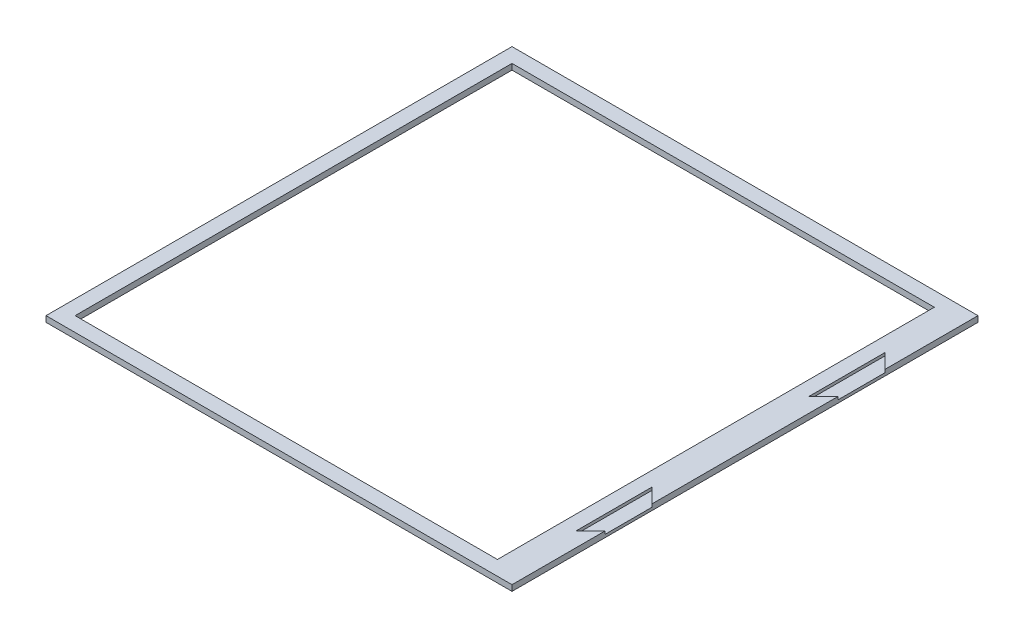
ISO-10303-21;
HEADER;
FILE_DESCRIPTION(('STEP AP214'),'2;1');
FILE_NAME('part.step','',(''),(''),'','','');
FILE_SCHEMA(('AUTOMOTIVE_DESIGN { 1 0 10303 214 1 1 1 1 }'));
ENDSEC;
DATA;
#1=APPLICATION_CONTEXT('core data for automotive mechanical design processes');
#2=APPLICATION_PROTOCOL_DEFINITION('international standard','automotive_design',2000,#1);
#3=PRODUCT_CONTEXT('',#1,'mechanical');
#4=PRODUCT('Part','Part','',(#3));
#5=PRODUCT_RELATED_PRODUCT_CATEGORY('part','',(#4));
#6=PRODUCT_DEFINITION_FORMATION('','',#4);
#7=PRODUCT_DEFINITION_CONTEXT('part definition',#1,'design');
#8=PRODUCT_DEFINITION('design','',#6,#7);
#9=PRODUCT_DEFINITION_SHAPE('','',#8);
#10=(LENGTH_UNIT() NAMED_UNIT(*) SI_UNIT(.MILLI.,.METRE.));
#11=(NAMED_UNIT(*) PLANE_ANGLE_UNIT() SI_UNIT($,.RADIAN.));
#12=(NAMED_UNIT(*) SI_UNIT($,.STERADIAN.) SOLID_ANGLE_UNIT());
#13=UNCERTAINTY_MEASURE_WITH_UNIT(LENGTH_MEASURE(1.E-05),#10,'distance_accuracy_value','');
#14=(GEOMETRIC_REPRESENTATION_CONTEXT(3) GLOBAL_UNCERTAINTY_ASSIGNED_CONTEXT((#13)) GLOBAL_UNIT_ASSIGNED_CONTEXT((#10,
#11,#12)) REPRESENTATION_CONTEXT('',''));
#15=CARTESIAN_POINT('',(0.,0.,0.));
#16=DIRECTION('',(0.,0.,1.));
#17=DIRECTION('',(1.,0.,0.));
#18=AXIS2_PLACEMENT_3D('',#15,#16,#17);
#19=CARTESIAN_POINT('',(-95.25,1.27,-95.25));
#20=DIRECTION('',(0.,0.,1.));
#21=DIRECTION('',(1.,0.,0.));
#22=AXIS2_PLACEMENT_3D('',#19,#20,#21);
#23=PLANE('',#22);
#24=DIRECTION('',(-1.,0.,0.));
#25=VECTOR('',#24,1.);
#26=CARTESIAN_POINT('',(-95.25,-1.27,-95.25));
#27=LINE('',#26,#25);
#28=CARTESIAN_POINT('',(88.9,-1.27,-95.25));
#29=VERTEX_POINT('',#28);
#30=CARTESIAN_POINT('',(-95.25,-1.27,-95.25));
#31=VERTEX_POINT('',#30);
#32=EDGE_CURVE('E215',#29,#31,#27,.T.);
#33=ORIENTED_EDGE('',*,*,#32,.F.);
#34=DIRECTION('',(0.,-1.,0.));
#35=VECTOR('',#34,1.);
#36=CARTESIAN_POINT('',(88.9,1.27,-95.25));
#37=LINE('',#36,#35);
#38=CARTESIAN_POINT('',(88.9,1.27,-95.25));
#39=VERTEX_POINT('',#38);
#40=EDGE_CURVE('E213',#39,#29,#37,.T.);
#41=ORIENTED_EDGE('',*,*,#40,.F.);
#42=DIRECTION('',(-1.,0.,0.));
#43=VECTOR('',#42,1.);
#44=CARTESIAN_POINT('',(-95.25,1.27,-95.25));
#45=LINE('',#44,#43);
#46=CARTESIAN_POINT('',(-95.25,1.27,-95.25));
#47=VERTEX_POINT('',#46);
#48=EDGE_CURVE('E216',#39,#47,#45,.T.);
#49=ORIENTED_EDGE('',*,*,#48,.T.);
#50=DIRECTION('',(0.,-1.,0.));
#51=VECTOR('',#50,1.);
#52=CARTESIAN_POINT('',(-95.25,1.27,-95.25));
#53=LINE('',#52,#51);
#54=EDGE_CURVE('E233',#47,#31,#53,.T.);
#55=ORIENTED_EDGE('',*,*,#54,.T.);
#56=EDGE_LOOP('',(#33,#41,#49,#55));
#57=FACE_BOUND('',#56,.T.);
#58=ADVANCED_FACE('F37',(#57),#23,.T.);
#59=CARTESIAN_POINT('',(-95.25,1.27,95.25));
#60=DIRECTION('',(0.,0.,-1.));
#61=DIRECTION('',(-1.,0.,0.));
#62=AXIS2_PLACEMENT_3D('',#59,#60,#61);
#63=PLANE('',#62);
#64=DIRECTION('',(1.,0.,0.));
#65=VECTOR('',#64,1.);
#66=CARTESIAN_POINT('',(-95.25,1.27,95.25));
#67=LINE('',#66,#65);
#68=CARTESIAN_POINT('',(-95.25,1.27,95.25));
#69=VERTEX_POINT('',#68);
#70=CARTESIAN_POINT('',(88.9,1.27,95.25));
#71=VERTEX_POINT('',#70);
#72=EDGE_CURVE('E222',#69,#71,#67,.T.);
#73=ORIENTED_EDGE('',*,*,#72,.T.);
#74=DIRECTION('',(0.,-1.,0.));
#75=VECTOR('',#74,1.);
#76=CARTESIAN_POINT('',(88.9,1.27,95.25));
#77=LINE('',#76,#75);
#78=CARTESIAN_POINT('',(88.9,-1.27,95.25));
#79=VERTEX_POINT('',#78);
#80=EDGE_CURVE('E207',#71,#79,#77,.T.);
#81=ORIENTED_EDGE('',*,*,#80,.T.);
#82=DIRECTION('',(1.,0.,0.));
#83=VECTOR('',#82,1.);
#84=CARTESIAN_POINT('',(-95.25,-1.27,95.25));
#85=LINE('',#84,#83);
#86=CARTESIAN_POINT('',(-95.25,-1.27,95.25));
#87=VERTEX_POINT('',#86);
#88=EDGE_CURVE('E219',#87,#79,#85,.T.);
#89=ORIENTED_EDGE('',*,*,#88,.F.);
#90=DIRECTION('',(0.,-1.,0.));
#91=VECTOR('',#90,1.);
#92=CARTESIAN_POINT('',(-95.25,1.27,95.25));
#93=LINE('',#92,#91);
#94=EDGE_CURVE('E225',#69,#87,#93,.T.);
#95=ORIENTED_EDGE('',*,*,#94,.F.);
#96=EDGE_LOOP('',(#73,#81,#89,#95));
#97=FACE_BOUND('',#96,.T.);
#98=ADVANCED_FACE('F292',(#97),#63,.T.);
#99=CARTESIAN_POINT('',(0.,1.27,0.));
#100=DIRECTION('',(0.,-1.,0.));
#101=DIRECTION('',(0.,0.,-1.));
#102=AXIS2_PLACEMENT_3D('',#99,#100,#101);
#103=PLANE('',#102);
#104=ORIENTED_EDGE('',*,*,#48,.F.);
#105=DIRECTION('',(0.,0.,1.));
#106=VECTOR('',#105,1.);
#107=CARTESIAN_POINT('',(88.9,1.27,-95.25));
#108=LINE('',#107,#106);
#109=EDGE_CURVE('E205',#39,#71,#108,.T.);
#110=ORIENTED_EDGE('',*,*,#109,.T.);
#111=ORIENTED_EDGE('',*,*,#72,.F.);
#112=DIRECTION('',(0.,0.,1.));
#113=VECTOR('',#112,1.);
#114=CARTESIAN_POINT('',(-95.25,1.27,95.25));
#115=LINE('',#114,#113);
#116=EDGE_CURVE('E218',#47,#69,#115,.T.);
#117=ORIENTED_EDGE('',*,*,#116,.F.);
#118=EDGE_LOOP('',(#104,#110,#111,#117));
#119=FACE_BOUND('',#118,.T.);
#120=DIRECTION('',(0.,0.,-1.));
#121=VECTOR('',#120,1.);
#122=CARTESIAN_POINT('',(101.6,1.27,101.6));
#123=LINE('',#122,#121);
#124=CARTESIAN_POINT('',(101.6,1.27,40.64));
#125=VERTEX_POINT('',#124);
#126=CARTESIAN_POINT('',(101.6,1.27,-40.64));
#127=VERTEX_POINT('',#126);
#128=EDGE_CURVE('E241',#125,#127,#123,.T.);
#129=ORIENTED_EDGE('',*,*,#128,.T.);
#130=DIRECTION('',(0.707106781186544,0.,-0.707106781186551));
#131=VECTOR('',#130,1.);
#132=CARTESIAN_POINT('',(101.6,1.27,-40.64));
#133=LINE('',#132,#131);
#134=CARTESIAN_POINT('',(95.25,1.27,-34.29));
#135=VERTEX_POINT('',#134);
#136=EDGE_CURVE('E168',#135,#127,#133,.T.);
#137=ORIENTED_EDGE('',*,*,#136,.F.);
#138=DIRECTION('',(0.,0.,1.));
#139=VECTOR('',#138,1.);
#140=CARTESIAN_POINT('',(95.25,1.27,-34.29));
#141=LINE('',#140,#139);
#142=CARTESIAN_POINT('',(95.25,1.27,-67.3100000000001));
#143=VERTEX_POINT('',#142);
#144=EDGE_CURVE('E502',#143,#135,#141,.T.);
#145=ORIENTED_EDGE('',*,*,#144,.F.);
#146=DIRECTION('',(-0.707106781186544,0.,-0.707106781186551));
#147=VECTOR('',#146,1.);
#148=CARTESIAN_POINT('',(95.25,1.27,-67.3100000000001));
#149=LINE('',#148,#147);
#150=CARTESIAN_POINT('',(101.6,1.27,-60.96));
#151=VERTEX_POINT('',#150);
#152=EDGE_CURVE('E197',#151,#143,#149,.T.);
#153=ORIENTED_EDGE('',*,*,#152,.F.);
#154=CARTESIAN_POINT('',(101.6,1.27,-101.6));
#155=VERTEX_POINT('',#154);
#156=EDGE_CURVE('E172',#151,#155,#123,.T.);
#157=ORIENTED_EDGE('',*,*,#156,.T.);
#158=DIRECTION('',(-1.,0.,0.));
#159=VECTOR('',#158,1.);
#160=CARTESIAN_POINT('',(-101.6,1.27,-101.6));
#161=LINE('',#160,#159);
#162=CARTESIAN_POINT('',(-101.6,1.27,-101.6));
#163=VERTEX_POINT('',#162);
#164=EDGE_CURVE('E240',#155,#163,#161,.T.);
#165=ORIENTED_EDGE('',*,*,#164,.T.);
#166=DIRECTION('',(0.,0.,1.));
#167=VECTOR('',#166,1.);
#168=CARTESIAN_POINT('',(-101.6,1.27,101.6));
#169=LINE('',#168,#167);
#170=CARTESIAN_POINT('',(-101.6,1.27,101.6));
#171=VERTEX_POINT('',#170);
#172=EDGE_CURVE('E243',#163,#171,#169,.T.);
#173=ORIENTED_EDGE('',*,*,#172,.T.);
#174=DIRECTION('',(1.,0.,0.));
#175=VECTOR('',#174,1.);
#176=CARTESIAN_POINT('',(-101.6,1.27,101.6));
#177=LINE('',#176,#175);
#178=CARTESIAN_POINT('',(101.6,1.27,101.6));
#179=VERTEX_POINT('',#178);
#180=EDGE_CURVE('E245',#171,#179,#177,.T.);
#181=ORIENTED_EDGE('',*,*,#180,.T.);
#182=CARTESIAN_POINT('',(101.6,1.27,60.96));
#183=VERTEX_POINT('',#182);
#184=EDGE_CURVE('E237',#179,#183,#123,.T.);
#185=ORIENTED_EDGE('',*,*,#184,.T.);
#186=DIRECTION('',(0.707106781186544,0.,-0.707106781186551));
#187=VECTOR('',#186,1.);
#188=CARTESIAN_POINT('',(95.25,1.27,67.3100000000001));
#189=LINE('',#188,#187);
#190=CARTESIAN_POINT('',(95.25,1.27,67.3100000000001));
#191=VERTEX_POINT('',#190);
#192=EDGE_CURVE('E195',#191,#183,#189,.T.);
#193=ORIENTED_EDGE('',*,*,#192,.F.);
#194=DIRECTION('',(0.,0.,1.));
#195=VECTOR('',#194,1.);
#196=CARTESIAN_POINT('',(95.25,1.27,34.29));
#197=LINE('',#196,#195);
#198=CARTESIAN_POINT('',(95.25,1.27,34.29));
#199=VERTEX_POINT('',#198);
#200=EDGE_CURVE('E189',#199,#191,#197,.T.);
#201=ORIENTED_EDGE('',*,*,#200,.F.);
#202=DIRECTION('',(-0.707106781186544,0.,-0.707106781186551));
#203=VECTOR('',#202,1.);
#204=CARTESIAN_POINT('',(101.6,1.27,40.64));
#205=LINE('',#204,#203);
#206=EDGE_CURVE('E192',#125,#199,#205,.T.);
#207=ORIENTED_EDGE('',*,*,#206,.F.);
#208=EDGE_LOOP('',(#129,#137,#145,#153,#157,#165,#173,#181,#185,#193,#201,#207));
#209=FACE_BOUND('',#208,.T.);
#210=ADVANCED_FACE('F282',(#119,#209),#103,.F.);
#211=CARTESIAN_POINT('',(0.,-1.27,0.));
#212=DIRECTION('',(0.,-1.,0.));
#213=DIRECTION('',(0.,0.,-1.));
#214=AXIS2_PLACEMENT_3D('',#211,#212,#213);
#215=PLANE('',#214);
#216=DIRECTION('',(0.,0.,1.));
#217=VECTOR('',#216,1.);
#218=CARTESIAN_POINT('',(88.9,-1.27,-95.25));
#219=LINE('',#218,#217);
#220=EDGE_CURVE('E208',#29,#79,#219,.T.);
#221=ORIENTED_EDGE('',*,*,#220,.F.);
#222=ORIENTED_EDGE('',*,*,#32,.T.);
#223=DIRECTION('',(0.,0.,1.));
#224=VECTOR('',#223,1.);
#225=CARTESIAN_POINT('',(-95.25,-1.27,95.25));
#226=LINE('',#225,#224);
#227=EDGE_CURVE('E227',#31,#87,#226,.T.);
#228=ORIENTED_EDGE('',*,*,#227,.T.);
#229=ORIENTED_EDGE('',*,*,#88,.T.);
#230=EDGE_LOOP('',(#221,#222,#228,#229));
#231=FACE_BOUND('',#230,.T.);
#232=DIRECTION('',(0.,0.,-1.));
#233=VECTOR('',#232,1.);
#234=CARTESIAN_POINT('',(101.6,-1.27,101.6));
#235=LINE('',#234,#233);
#236=CARTESIAN_POINT('',(101.6,-1.27,101.6));
#237=VERTEX_POINT('',#236);
#238=CARTESIAN_POINT('',(101.6,-1.27,-101.6));
#239=VERTEX_POINT('',#238);
#240=EDGE_CURVE('E236',#237,#239,#235,.T.);
#241=ORIENTED_EDGE('',*,*,#240,.F.);
#242=DIRECTION('',(1.,0.,0.));
#243=VECTOR('',#242,1.);
#244=CARTESIAN_POINT('',(-101.6,-1.27,101.6));
#245=LINE('',#244,#243);
#246=CARTESIAN_POINT('',(-101.6,-1.27,101.6));
#247=VERTEX_POINT('',#246);
#248=EDGE_CURVE('E254',#247,#237,#245,.T.);
#249=ORIENTED_EDGE('',*,*,#248,.F.);
#250=DIRECTION('',(0.,0.,1.));
#251=VECTOR('',#250,1.);
#252=CARTESIAN_POINT('',(-101.6,-1.27,101.6));
#253=LINE('',#252,#251);
#254=CARTESIAN_POINT('',(-101.6,-1.27,-101.6));
#255=VERTEX_POINT('',#254);
#256=EDGE_CURVE('E252',#255,#247,#253,.T.);
#257=ORIENTED_EDGE('',*,*,#256,.F.);
#258=DIRECTION('',(-1.,0.,0.));
#259=VECTOR('',#258,1.);
#260=CARTESIAN_POINT('',(-101.6,-1.27,-101.6));
#261=LINE('',#260,#259);
#262=EDGE_CURVE('E250',#239,#255,#261,.T.);
#263=ORIENTED_EDGE('',*,*,#262,.F.);
#264=EDGE_LOOP('',(#241,#249,#257,#263));
#265=FACE_BOUND('',#264,.T.);
#266=ADVANCED_FACE('F272',(#231,#265),#215,.T.);
#267=CARTESIAN_POINT('',(101.6,1.27,101.6));
#268=DIRECTION('',(-1.,0.,0.));
#269=DIRECTION('',(0.,0.,1.));
#270=AXIS2_PLACEMENT_3D('',#267,#268,#269);
#271=PLANE('',#270);
#272=DIRECTION('',(0.,0.,-1.));
#273=VECTOR('',#272,1.);
#274=CARTESIAN_POINT('',(101.6,0.,-60.96));
#275=LINE('',#274,#273);
#276=CARTESIAN_POINT('',(101.6,0.,-40.64));
#277=VERTEX_POINT('',#276);
#278=CARTESIAN_POINT('',(101.6,0.,-60.96));
#279=VERTEX_POINT('',#278);
#280=EDGE_CURVE('E162',#277,#279,#275,.T.);
#281=ORIENTED_EDGE('',*,*,#280,.F.);
#282=DIRECTION('',(0.,1.,0.));
#283=VECTOR('',#282,1.);
#284=CARTESIAN_POINT('',(101.6,0.,-40.64));
#285=LINE('',#284,#283);
#286=EDGE_CURVE('E210',#277,#127,#285,.T.);
#287=ORIENTED_EDGE('',*,*,#286,.T.);
#288=ORIENTED_EDGE('',*,*,#128,.F.);
#289=DIRECTION('',(0.,1.,0.));
#290=VECTOR('',#289,1.);
#291=CARTESIAN_POINT('',(101.6,0.,40.64));
#292=LINE('',#291,#290);
#293=CARTESIAN_POINT('',(101.6,0.,40.64));
#294=VERTEX_POINT('',#293);
#295=EDGE_CURVE('E183',#294,#125,#292,.T.);
#296=ORIENTED_EDGE('',*,*,#295,.F.);
#297=DIRECTION('',(0.,0.,-1.));
#298=VECTOR('',#297,1.);
#299=CARTESIAN_POINT('',(101.6,0.,60.96));
#300=LINE('',#299,#298);
#301=CARTESIAN_POINT('',(101.6,0.,60.96));
#302=VERTEX_POINT('',#301);
#303=EDGE_CURVE('E202',#302,#294,#300,.T.);
#304=ORIENTED_EDGE('',*,*,#303,.F.);
#305=DIRECTION('',(0.,1.,0.));
#306=VECTOR('',#305,1.);
#307=CARTESIAN_POINT('',(101.6,0.,60.96));
#308=LINE('',#307,#306);
#309=EDGE_CURVE('E179',#302,#183,#308,.T.);
#310=ORIENTED_EDGE('',*,*,#309,.T.);
#311=ORIENTED_EDGE('',*,*,#184,.F.);
#312=DIRECTION('',(0.,-1.,0.));
#313=VECTOR('',#312,1.);
#314=CARTESIAN_POINT('',(101.6,1.27,101.6));
#315=LINE('',#314,#313);
#316=EDGE_CURVE('E247',#179,#237,#315,.T.);
#317=ORIENTED_EDGE('',*,*,#316,.T.);
#318=ORIENTED_EDGE('',*,*,#240,.T.);
#319=DIRECTION('',(0.,-1.,0.));
#320=VECTOR('',#319,1.);
#321=CARTESIAN_POINT('',(101.6,1.27,-101.6));
#322=LINE('',#321,#320);
#323=EDGE_CURVE('E11',#155,#239,#322,.T.);
#324=ORIENTED_EDGE('',*,*,#323,.F.);
#325=ORIENTED_EDGE('',*,*,#156,.F.);
#326=DIRECTION('',(0.,1.,0.));
#327=VECTOR('',#326,1.);
#328=CARTESIAN_POINT('',(101.6,0.,-60.96));
#329=LINE('',#328,#327);
#330=EDGE_CURVE('E157',#279,#151,#329,.T.);
#331=ORIENTED_EDGE('',*,*,#330,.F.);
#332=EDGE_LOOP('',(#281,#287,#288,#296,#304,#310,#311,#317,#318,#324,#325,#331));
#333=FACE_BOUND('',#332,.T.);
#334=ADVANCED_FACE('F39',(#333),#271,.F.);
#335=CARTESIAN_POINT('',(-101.6,1.27,-101.6));
#336=DIRECTION('',(0.,0.,1.));
#337=DIRECTION('',(1.,0.,0.));
#338=AXIS2_PLACEMENT_3D('',#335,#336,#337);
#339=PLANE('',#338);
#340=ORIENTED_EDGE('',*,*,#262,.T.);
#341=DIRECTION('',(0.,-1.,0.));
#342=VECTOR('',#341,1.);
#343=CARTESIAN_POINT('',(-101.6,1.27,-101.6));
#344=LINE('',#343,#342);
#345=EDGE_CURVE('E45',#163,#255,#344,.T.);
#346=ORIENTED_EDGE('',*,*,#345,.F.);
#347=ORIENTED_EDGE('',*,*,#164,.F.);
#348=ORIENTED_EDGE('',*,*,#323,.T.);
#349=EDGE_LOOP('',(#340,#346,#347,#348));
#350=FACE_BOUND('',#349,.T.);
#351=ADVANCED_FACE('F284',(#350),#339,.F.);
#352=CARTESIAN_POINT('',(-101.6,1.27,101.6));
#353=DIRECTION('',(1.,0.,0.));
#354=DIRECTION('',(0.,0.,-1.));
#355=AXIS2_PLACEMENT_3D('',#352,#353,#354);
#356=PLANE('',#355);
#357=ORIENTED_EDGE('',*,*,#256,.T.);
#358=DIRECTION('',(0.,-1.,0.));
#359=VECTOR('',#358,1.);
#360=CARTESIAN_POINT('',(-101.6,1.27,101.6));
#361=LINE('',#360,#359);
#362=EDGE_CURVE('E258',#171,#247,#361,.T.);
#363=ORIENTED_EDGE('',*,*,#362,.F.);
#364=ORIENTED_EDGE('',*,*,#172,.F.);
#365=ORIENTED_EDGE('',*,*,#345,.T.);
#366=EDGE_LOOP('',(#357,#363,#364,#365));
#367=FACE_BOUND('',#366,.T.);
#368=ADVANCED_FACE('F265',(#367),#356,.F.);
#369=CARTESIAN_POINT('',(-101.6,1.27,101.6));
#370=DIRECTION('',(0.,0.,-1.));
#371=DIRECTION('',(-1.,0.,0.));
#372=AXIS2_PLACEMENT_3D('',#369,#370,#371);
#373=PLANE('',#372);
#374=ORIENTED_EDGE('',*,*,#248,.T.);
#375=ORIENTED_EDGE('',*,*,#316,.F.);
#376=ORIENTED_EDGE('',*,*,#180,.F.);
#377=ORIENTED_EDGE('',*,*,#362,.T.);
#378=EDGE_LOOP('',(#374,#375,#376,#377));
#379=FACE_BOUND('',#378,.T.);
#380=ADVANCED_FACE('F275',(#379),#373,.F.);
#381=CARTESIAN_POINT('',(-95.25,1.27,95.25));
#382=DIRECTION('',(1.,0.,0.));
#383=DIRECTION('',(0.,0.,-1.));
#384=AXIS2_PLACEMENT_3D('',#381,#382,#383);
#385=PLANE('',#384);
#386=ORIENTED_EDGE('',*,*,#227,.F.);
#387=ORIENTED_EDGE('',*,*,#54,.F.);
#388=ORIENTED_EDGE('',*,*,#116,.T.);
#389=ORIENTED_EDGE('',*,*,#94,.T.);
#390=EDGE_LOOP('',(#386,#387,#388,#389));
#391=FACE_BOUND('',#390,.T.);
#392=ADVANCED_FACE('F303',(#391),#385,.T.);
#393=CARTESIAN_POINT('',(88.9,1.27,-95.25));
#394=DIRECTION('',(1.,0.,0.));
#395=DIRECTION('',(0.,0.,-1.));
#396=AXIS2_PLACEMENT_3D('',#393,#394,#395);
#397=PLANE('',#396);
#398=ORIENTED_EDGE('',*,*,#220,.T.);
#399=ORIENTED_EDGE('',*,*,#80,.F.);
#400=ORIENTED_EDGE('',*,*,#109,.F.);
#401=ORIENTED_EDGE('',*,*,#40,.T.);
#402=EDGE_LOOP('',(#398,#399,#400,#401));
#403=FACE_BOUND('',#402,.T.);
#404=ADVANCED_FACE('F314',(#403),#397,.F.);
#405=CARTESIAN_POINT('',(95.25,0.,67.3100000000001));
#406=DIRECTION('',(0.707106781186551,0.,0.707106781186544));
#407=DIRECTION('',(0.707106781186544,0.,-0.707106781186551));
#408=AXIS2_PLACEMENT_3D('',#405,#406,#407);
#409=PLANE('',#408);
#410=ORIENTED_EDGE('',*,*,#192,.T.);
#411=ORIENTED_EDGE('',*,*,#309,.F.);
#412=DIRECTION('',(0.707106781186544,0.,-0.707106781186551));
#413=VECTOR('',#412,1.);
#414=CARTESIAN_POINT('',(95.25,0.,67.3100000000001));
#415=LINE('',#414,#413);
#416=CARTESIAN_POINT('',(95.25,0.,67.3100000000001));
#417=VERTEX_POINT('',#416);
#418=EDGE_CURVE('E60',#417,#302,#415,.T.);
#419=ORIENTED_EDGE('',*,*,#418,.F.);
#420=DIRECTION('',(0.,1.,0.));
#421=VECTOR('',#420,1.);
#422=CARTESIAN_POINT('',(95.25,0.,67.3100000000001));
#423=LINE('',#422,#421);
#424=EDGE_CURVE('E187',#417,#191,#423,.T.);
#425=ORIENTED_EDGE('',*,*,#424,.T.);
#426=EDGE_LOOP('',(#410,#411,#419,#425));
#427=FACE_BOUND('',#426,.T.);
#428=ADVANCED_FACE('F319',(#427),#409,.F.);
#429=CARTESIAN_POINT('',(95.25,0.,34.29));
#430=DIRECTION('',(-1.,0.,0.));
#431=DIRECTION('',(0.,0.,1.));
#432=AXIS2_PLACEMENT_3D('',#429,#430,#431);
#433=PLANE('',#432);
#434=ORIENTED_EDGE('',*,*,#200,.T.);
#435=ORIENTED_EDGE('',*,*,#424,.F.);
#436=DIRECTION('',(0.,0.,1.));
#437=VECTOR('',#436,1.);
#438=CARTESIAN_POINT('',(95.25,0.,34.29));
#439=LINE('',#438,#437);
#440=CARTESIAN_POINT('',(95.25,0.,34.29));
#441=VERTEX_POINT('',#440);
#442=EDGE_CURVE('E182',#441,#417,#439,.T.);
#443=ORIENTED_EDGE('',*,*,#442,.F.);
#444=DIRECTION('',(0.,1.,0.));
#445=VECTOR('',#444,1.);
#446=CARTESIAN_POINT('',(95.25,0.,34.29));
#447=LINE('',#446,#445);
#448=EDGE_CURVE('E185',#441,#199,#447,.T.);
#449=ORIENTED_EDGE('',*,*,#448,.T.);
#450=EDGE_LOOP('',(#434,#435,#443,#449));
#451=FACE_BOUND('',#450,.T.);
#452=ADVANCED_FACE('F334',(#451),#433,.F.);
#453=CARTESIAN_POINT('',(101.6,0.,40.64));
#454=DIRECTION('',(0.707106781186551,0.,-0.707106781186544));
#455=DIRECTION('',(-0.707106781186544,0.,-0.707106781186551));
#456=AXIS2_PLACEMENT_3D('',#453,#454,#455);
#457=PLANE('',#456);
#458=ORIENTED_EDGE('',*,*,#206,.T.);
#459=ORIENTED_EDGE('',*,*,#448,.F.);
#460=DIRECTION('',(-0.707106781186544,0.,-0.707106781186551));
#461=VECTOR('',#460,1.);
#462=CARTESIAN_POINT('',(101.6,0.,40.64));
#463=LINE('',#462,#461);
#464=EDGE_CURVE('E199',#294,#441,#463,.T.);
#465=ORIENTED_EDGE('',*,*,#464,.F.);
#466=ORIENTED_EDGE('',*,*,#295,.T.);
#467=EDGE_LOOP('',(#458,#459,#465,#466));
#468=FACE_BOUND('',#467,.T.);
#469=ADVANCED_FACE('F342',(#468),#457,.F.);
#470=CARTESIAN_POINT('',(0.,0.,0.));
#471=DIRECTION('',(0.,1.,0.));
#472=DIRECTION('',(0.,0.,1.));
#473=AXIS2_PLACEMENT_3D('',#470,#471,#472);
#474=PLANE('',#473);
#475=ORIENTED_EDGE('',*,*,#418,.T.);
#476=ORIENTED_EDGE('',*,*,#303,.T.);
#477=ORIENTED_EDGE('',*,*,#464,.T.);
#478=ORIENTED_EDGE('',*,*,#442,.T.);
#479=EDGE_LOOP('',(#475,#476,#477,#478));
#480=FACE_BOUND('',#479,.T.);
#481=ADVANCED_FACE('F338',(#480),#474,.T.);
#482=CARTESIAN_POINT('',(101.6,0.,-40.64));
#483=DIRECTION('',(0.707106781186551,0.,0.707106781186544));
#484=DIRECTION('',(0.707106781186544,0.,-0.707106781186551));
#485=AXIS2_PLACEMENT_3D('',#482,#483,#484);
#486=PLANE('',#485);
#487=ORIENTED_EDGE('',*,*,#136,.T.);
#488=ORIENTED_EDGE('',*,*,#286,.F.);
#489=DIRECTION('',(0.707106781186544,0.,-0.707106781186551));
#490=VECTOR('',#489,1.);
#491=CARTESIAN_POINT('',(101.6,0.,-40.64));
#492=LINE('',#491,#490);
#493=CARTESIAN_POINT('',(95.25,0.,-34.29));
#494=VERTEX_POINT('',#493);
#495=EDGE_CURVE('E52',#494,#277,#492,.T.);
#496=ORIENTED_EDGE('',*,*,#495,.F.);
#497=DIRECTION('',(0.,1.,0.));
#498=VECTOR('',#497,1.);
#499=CARTESIAN_POINT('',(95.25,0.,-34.29));
#500=LINE('',#499,#498);
#501=EDGE_CURVE('E174',#494,#135,#500,.T.);
#502=ORIENTED_EDGE('',*,*,#501,.T.);
#503=EDGE_LOOP('',(#487,#488,#496,#502));
#504=FACE_BOUND('',#503,.T.);
#505=ADVANCED_FACE('F341',(#504),#486,.F.);
#506=CARTESIAN_POINT('',(95.25,0.,-34.29));
#507=DIRECTION('',(-1.,0.,0.));
#508=DIRECTION('',(0.,0.,1.));
#509=AXIS2_PLACEMENT_3D('',#506,#507,#508);
#510=PLANE('',#509);
#511=ORIENTED_EDGE('',*,*,#144,.T.);
#512=ORIENTED_EDGE('',*,*,#501,.F.);
#513=DIRECTION('',(0.,0.,1.));
#514=VECTOR('',#513,1.);
#515=CARTESIAN_POINT('',(95.25,0.,-34.29));
#516=LINE('',#515,#514);
#517=CARTESIAN_POINT('',(95.25,0.,-67.3100000000001));
#518=VERTEX_POINT('',#517);
#519=EDGE_CURVE('E161',#518,#494,#516,.T.);
#520=ORIENTED_EDGE('',*,*,#519,.F.);
#521=DIRECTION('',(0.,1.,0.));
#522=VECTOR('',#521,1.);
#523=CARTESIAN_POINT('',(95.25,0.,-67.3100000000001));
#524=LINE('',#523,#522);
#525=EDGE_CURVE('E159',#518,#143,#524,.T.);
#526=ORIENTED_EDGE('',*,*,#525,.T.);
#527=EDGE_LOOP('',(#511,#512,#520,#526));
#528=FACE_BOUND('',#527,.T.);
#529=ADVANCED_FACE('F351',(#528),#510,.F.);
#530=CARTESIAN_POINT('',(95.25,0.,-67.3100000000001));
#531=DIRECTION('',(0.707106781186551,0.,-0.707106781186544));
#532=DIRECTION('',(-0.707106781186544,0.,-0.707106781186551));
#533=AXIS2_PLACEMENT_3D('',#530,#531,#532);
#534=PLANE('',#533);
#535=ORIENTED_EDGE('',*,*,#152,.T.);
#536=ORIENTED_EDGE('',*,*,#525,.F.);
#537=DIRECTION('',(-0.707106781186544,0.,-0.707106781186551));
#538=VECTOR('',#537,1.);
#539=CARTESIAN_POINT('',(95.25,0.,-67.3100000000001));
#540=LINE('',#539,#538);
#541=EDGE_CURVE('E153',#279,#518,#540,.T.);
#542=ORIENTED_EDGE('',*,*,#541,.F.);
#543=ORIENTED_EDGE('',*,*,#330,.T.);
#544=EDGE_LOOP('',(#535,#536,#542,#543));
#545=FACE_BOUND('',#544,.T.);
#546=ADVANCED_FACE('F155',(#545),#534,.F.);
#547=CARTESIAN_POINT('',(0.,0.,0.));
#548=DIRECTION('',(0.,-1.,0.));
#549=DIRECTION('',(0.,0.,-1.));
#550=AXIS2_PLACEMENT_3D('',#547,#548,#549);
#551=PLANE('',#550);
#552=ORIENTED_EDGE('',*,*,#280,.T.);
#553=ORIENTED_EDGE('',*,*,#541,.T.);
#554=ORIENTED_EDGE('',*,*,#519,.T.);
#555=ORIENTED_EDGE('',*,*,#495,.T.);
#556=EDGE_LOOP('',(#552,#553,#554,#555));
#557=FACE_BOUND('',#556,.T.);
#558=ADVANCED_FACE('F165',(#557),#551,.F.);
#559=CLOSED_SHELL('',(#58,#98,#210,#266,#334,#351,#368,#380,#392,#404,#428,#452,#469,#481,#505,
#529,#546,#558));
#560=MANIFOLD_SOLID_BREP('B2',#559);
#561=ADVANCED_BREP_SHAPE_REPRESENTATION('',(#18,#560),#14);
#562=SHAPE_DEFINITION_REPRESENTATION(#9,#561);
ENDSEC;
END-ISO-10303-21;
